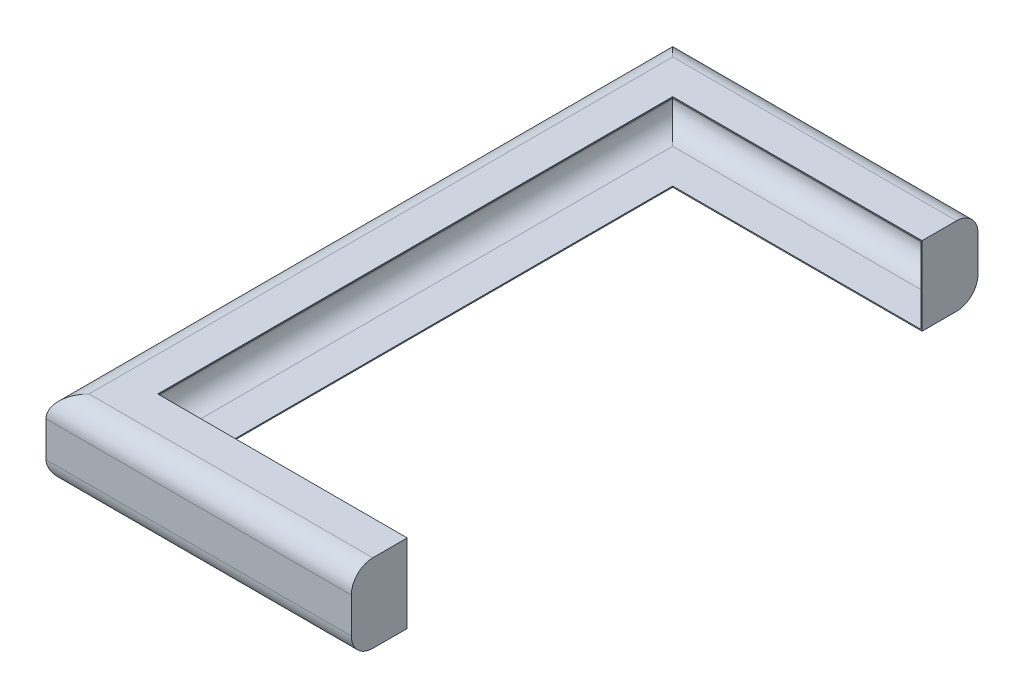
ISO-10303-21;
HEADER;
FILE_DESCRIPTION(('STEP AP214'),'2;1');
FILE_NAME('part.step','',(''),(''),'','','');
FILE_SCHEMA(('AUTOMOTIVE_DESIGN { 1 0 10303 214 1 1 1 1 }'));
ENDSEC;
DATA;
#1=APPLICATION_CONTEXT('core data for automotive mechanical design processes');
#2=APPLICATION_PROTOCOL_DEFINITION('international standard','automotive_design',2000,#1);
#3=PRODUCT_CONTEXT('',#1,'mechanical');
#4=PRODUCT('Part','Part','',(#3));
#5=PRODUCT_RELATED_PRODUCT_CATEGORY('part','',(#4));
#6=PRODUCT_DEFINITION_FORMATION('','',#4);
#7=PRODUCT_DEFINITION_CONTEXT('part definition',#1,'design');
#8=PRODUCT_DEFINITION('design','',#6,#7);
#9=PRODUCT_DEFINITION_SHAPE('','',#8);
#10=(LENGTH_UNIT() NAMED_UNIT(*) SI_UNIT(.MILLI.,.METRE.));
#11=(NAMED_UNIT(*) PLANE_ANGLE_UNIT() SI_UNIT($,.RADIAN.));
#12=(NAMED_UNIT(*) SI_UNIT($,.STERADIAN.) SOLID_ANGLE_UNIT());
#13=UNCERTAINTY_MEASURE_WITH_UNIT(LENGTH_MEASURE(1.E-05),#10,'distance_accuracy_value','');
#14=(GEOMETRIC_REPRESENTATION_CONTEXT(3) GLOBAL_UNCERTAINTY_ASSIGNED_CONTEXT((#13)) GLOBAL_UNIT_ASSIGNED_CONTEXT((#10,
#11,#12)) REPRESENTATION_CONTEXT('',''));
#15=CARTESIAN_POINT('',(0.,0.,0.));
#16=DIRECTION('',(0.,0.,1.));
#17=DIRECTION('',(1.,0.,0.));
#18=AXIS2_PLACEMENT_3D('',#15,#16,#17);
#19=CARTESIAN_POINT('',(1.5899202076085E-13,57.94375,380.2126));
#20=DIRECTION('',(0.,0.,1.));
#21=DIRECTION('',(1.,0.,0.));
#22=AXIS2_PLACEMENT_3D('',#19,#20,#21);
#23=PLANE('',#22);
#24=DIRECTION('',(-1.,0.,0.));
#25=VECTOR('',#24,1.);
#26=CARTESIAN_POINT('',(0.,-56.35625,380.2126));
#27=LINE('',#26,#25);
#28=CARTESIAN_POINT('',(366.7125,-56.35625,380.2126));
#29=VERTEX_POINT('',#28);
#30=CARTESIAN_POINT('',(1.5899202076085E-13,-56.35625,380.2126));
#31=VERTEX_POINT('',#30);
#32=EDGE_CURVE('E269',#29,#31,#27,.T.);
#33=ORIENTED_EDGE('',*,*,#32,.F.);
#34=DIRECTION('',(0.,-1.,0.));
#35=VECTOR('',#34,1.);
#36=CARTESIAN_POINT('',(366.7125,57.94375,380.2126));
#37=LINE('',#36,#35);
#38=CARTESIAN_POINT('',(366.7125,56.35625,380.2126));
#39=VERTEX_POINT('',#38);
#40=EDGE_CURVE('E263',#39,#29,#37,.T.);
#41=ORIENTED_EDGE('',*,*,#40,.F.);
#42=DIRECTION('',(-1.,0.,0.));
#43=VECTOR('',#42,1.);
#44=CARTESIAN_POINT('',(0.,56.35625,380.2126));
#45=LINE('',#44,#43);
#46=CARTESIAN_POINT('',(1.5899202076085E-13,56.35625,380.2126));
#47=VERTEX_POINT('',#46);
#48=EDGE_CURVE('E273',#39,#47,#45,.T.);
#49=ORIENTED_EDGE('',*,*,#48,.T.);
#50=DIRECTION('',(0.,-1.,0.));
#51=VECTOR('',#50,1.);
#52=CARTESIAN_POINT('',(1.5899202076085E-13,57.94375,380.2126));
#53=LINE('',#52,#51);
#54=CARTESIAN_POINT('',(1.5899202076085E-13,57.94375,380.2126));
#55=VERTEX_POINT('',#54);
#56=EDGE_CURVE('E346',#55,#47,#53,.T.);
#57=ORIENTED_EDGE('',*,*,#56,.F.);
#58=DIRECTION('',(-1.,0.,0.));
#59=VECTOR('',#58,1.);
#60=CARTESIAN_POINT('',(1.5899202076085E-13,57.94375,380.2126));
#61=LINE('',#60,#59);
#62=CARTESIAN_POINT('',(368.3,57.94375,380.2126));
#63=VERTEX_POINT('',#62);
#64=EDGE_CURVE('E319',#63,#55,#61,.T.);
#65=ORIENTED_EDGE('',*,*,#64,.F.);
#66=DIRECTION('',(0.,-1.,0.));
#67=VECTOR('',#66,1.);
#68=CARTESIAN_POINT('',(368.3,57.94375,380.2126));
#69=LINE('',#68,#67);
#70=CARTESIAN_POINT('',(368.3,-57.94375,380.2126));
#71=VERTEX_POINT('',#70);
#72=EDGE_CURVE('E349',#63,#71,#69,.T.);
#73=ORIENTED_EDGE('',*,*,#72,.T.);
#74=DIRECTION('',(-1.,0.,0.));
#75=VECTOR('',#74,1.);
#76=CARTESIAN_POINT('',(1.5899202076085E-13,-57.94375,380.2126));
#77=LINE('',#76,#75);
#78=CARTESIAN_POINT('',(1.5899202076085E-13,-57.94375,380.2126));
#79=VERTEX_POINT('',#78);
#80=EDGE_CURVE('E332',#71,#79,#77,.T.);
#81=ORIENTED_EDGE('',*,*,#80,.T.);
#82=EDGE_CURVE('E345',#31,#79,#53,.T.);
#83=ORIENTED_EDGE('',*,*,#82,.F.);
#84=EDGE_LOOP('',(#33,#41,#49,#57,#65,#73,#81,#83));
#85=FACE_BOUND('',#84,.T.);
#86=ADVANCED_FACE('F49',(#85),#23,.F.);
#87=CARTESIAN_POINT('',(1.5899202076085E-13,57.94375,-380.2126));
#88=DIRECTION('',(-1.,0.,0.));
#89=DIRECTION('',(0.,0.,1.));
#90=AXIS2_PLACEMENT_3D('',#87,#88,#89);
#91=PLANE('',#90);
#92=DIRECTION('',(0.,0.,-1.));
#93=VECTOR('',#92,1.);
#94=CARTESIAN_POINT('',(1.5899202076085E-13,-56.35625,0.));
#95=LINE('',#94,#93);
#96=CARTESIAN_POINT('',(1.5899202076085E-13,-56.35625,-380.2126));
#97=VERTEX_POINT('',#96);
#98=EDGE_CURVE('E309',#31,#97,#95,.T.);
#99=ORIENTED_EDGE('',*,*,#98,.F.);
#100=ORIENTED_EDGE('',*,*,#82,.T.);
#101=DIRECTION('',(0.,0.,-1.));
#102=VECTOR('',#101,1.);
#103=CARTESIAN_POINT('',(1.5899202076085E-13,-57.94375,-380.2126));
#104=LINE('',#103,#102);
#105=CARTESIAN_POINT('',(1.5899202076085E-13,-57.94375,-380.2126));
#106=VERTEX_POINT('',#105);
#107=EDGE_CURVE('E335',#79,#106,#104,.T.);
#108=ORIENTED_EDGE('',*,*,#107,.T.);
#109=DIRECTION('',(0.,-1.,0.));
#110=VECTOR('',#109,1.);
#111=CARTESIAN_POINT('',(1.5899202076085E-13,57.94375,-380.2126));
#112=LINE('',#111,#110);
#113=EDGE_CURVE('E341',#97,#106,#112,.T.);
#114=ORIENTED_EDGE('',*,*,#113,.F.);
#115=EDGE_LOOP('',(#99,#100,#108,#114));
#116=FACE_BOUND('',#115,.T.);
#117=ADVANCED_FACE('F467',(#116),#91,.F.);
#118=CARTESIAN_POINT('',(368.3,57.94375,-380.2126));
#119=DIRECTION('',(0.,0.,-1.));
#120=DIRECTION('',(-1.,0.,0.));
#121=AXIS2_PLACEMENT_3D('',#118,#119,#120);
#122=PLANE('',#121);
#123=DIRECTION('',(1.,0.,0.));
#124=VECTOR('',#123,1.);
#125=CARTESIAN_POINT('',(0.,-56.35625,-380.2126));
#126=LINE('',#125,#124);
#127=CARTESIAN_POINT('',(366.7125,-56.35625,-380.2126));
#128=VERTEX_POINT('',#127);
#129=EDGE_CURVE('E311',#97,#128,#126,.T.);
#130=ORIENTED_EDGE('',*,*,#129,.F.);
#131=ORIENTED_EDGE('',*,*,#113,.T.);
#132=DIRECTION('',(1.,0.,0.));
#133=VECTOR('',#132,1.);
#134=CARTESIAN_POINT('',(368.3,-57.94375,-380.2126));
#135=LINE('',#134,#133);
#136=CARTESIAN_POINT('',(368.3,-57.94375,-380.2126));
#137=VERTEX_POINT('',#136);
#138=EDGE_CURVE('E317',#106,#137,#135,.T.);
#139=ORIENTED_EDGE('',*,*,#138,.T.);
#140=DIRECTION('',(0.,-1.,0.));
#141=VECTOR('',#140,1.);
#142=CARTESIAN_POINT('',(368.3,57.94375,-380.2126));
#143=LINE('',#142,#141);
#144=CARTESIAN_POINT('',(368.3,57.94375,-380.2126));
#145=VERTEX_POINT('',#144);
#146=EDGE_CURVE('E325',#145,#137,#143,.T.);
#147=ORIENTED_EDGE('',*,*,#146,.F.);
#148=DIRECTION('',(1.,0.,0.));
#149=VECTOR('',#148,1.);
#150=CARTESIAN_POINT('',(368.3,57.94375,-380.2126));
#151=LINE('',#150,#149);
#152=CARTESIAN_POINT('',(1.5899202076085E-13,57.94375,-380.2126));
#153=VERTEX_POINT('',#152);
#154=EDGE_CURVE('E323',#153,#145,#151,.T.);
#155=ORIENTED_EDGE('',*,*,#154,.F.);
#156=CARTESIAN_POINT('',(1.5899202076085E-13,56.35625,-380.2126));
#157=VERTEX_POINT('',#156);
#158=EDGE_CURVE('E342',#153,#157,#112,.T.);
#159=ORIENTED_EDGE('',*,*,#158,.T.);
#160=DIRECTION('',(1.,0.,0.));
#161=VECTOR('',#160,1.);
#162=CARTESIAN_POINT('',(0.,56.35625,-380.2126));
#163=LINE('',#162,#161);
#164=CARTESIAN_POINT('',(366.7125,56.35625,-380.2126));
#165=VERTEX_POINT('',#164);
#166=EDGE_CURVE('E298',#157,#165,#163,.T.);
#167=ORIENTED_EDGE('',*,*,#166,.T.);
#168=DIRECTION('',(0.,-1.,0.));
#169=VECTOR('',#168,1.);
#170=CARTESIAN_POINT('',(366.7125,57.94375,-380.2126));
#171=LINE('',#170,#169);
#172=EDGE_CURVE('E295',#165,#128,#171,.T.);
#173=ORIENTED_EDGE('',*,*,#172,.T.);
#174=EDGE_LOOP('',(#130,#131,#139,#147,#155,#159,#167,#173));
#175=FACE_BOUND('',#174,.T.);
#176=ADVANCED_FACE('F428',(#175),#122,.F.);
#177=CARTESIAN_POINT('',(368.3,57.94375,-462.7626));
#178=DIRECTION('',(-1.,0.,0.));
#179=DIRECTION('',(0.,0.,1.));
#180=AXIS2_PLACEMENT_3D('',#177,#178,#179);
#181=PLANE('',#180);
#182=DIRECTION('',(0.,0.,-1.));
#183=VECTOR('',#182,1.);
#184=CARTESIAN_POINT('',(368.3,-57.94375,-462.7626));
#185=LINE('',#184,#183);
#186=CARTESIAN_POINT('',(368.3,-57.94375,-431.0126));
#187=VERTEX_POINT('',#186);
#188=EDGE_CURVE('E326',#137,#187,#185,.T.);
#189=ORIENTED_EDGE('',*,*,#188,.T.);
#190=CARTESIAN_POINT('',(368.3,-26.19375,-431.0126));
#191=DIRECTION('',(-1.,0.,0.));
#192=DIRECTION('',(0.,0.,1.));
#193=AXIS2_PLACEMENT_3D('',#190,#191,#192);
#194=CIRCLE('',#193,31.75);
#195=CARTESIAN_POINT('',(368.3,-26.19375,-462.7626));
#196=VERTEX_POINT('',#195);
#197=EDGE_CURVE('E389',#187,#196,#194,.F.);
#198=ORIENTED_EDGE('',*,*,#197,.T.);
#199=DIRECTION('',(0.,-1.,0.));
#200=VECTOR('',#199,1.);
#201=CARTESIAN_POINT('',(368.3,57.94375,-462.7626));
#202=LINE('',#201,#200);
#203=CARTESIAN_POINT('',(368.3,26.19375,-462.7626));
#204=VERTEX_POINT('',#203);
#205=EDGE_CURVE('E361',#204,#196,#202,.T.);
#206=ORIENTED_EDGE('',*,*,#205,.F.);
#207=CARTESIAN_POINT('',(368.3,26.19375,-431.0126));
#208=DIRECTION('',(-1.,0.,0.));
#209=DIRECTION('',(0.,0.,1.));
#210=AXIS2_PLACEMENT_3D('',#207,#208,#209);
#211=CIRCLE('',#210,31.75);
#212=CARTESIAN_POINT('',(368.3,57.94375,-431.0126));
#213=VERTEX_POINT('',#212);
#214=EDGE_CURVE('E387',#204,#213,#211,.F.);
#215=ORIENTED_EDGE('',*,*,#214,.T.);
#216=DIRECTION('',(0.,0.,-1.));
#217=VECTOR('',#216,1.);
#218=CARTESIAN_POINT('',(368.3,57.94375,-462.7626));
#219=LINE('',#218,#217);
#220=EDGE_CURVE('E313',#145,#213,#219,.T.);
#221=ORIENTED_EDGE('',*,*,#220,.F.);
#222=ORIENTED_EDGE('',*,*,#146,.T.);
#223=EDGE_LOOP('',(#189,#198,#206,#215,#221,#222));
#224=FACE_BOUND('',#223,.T.);
#225=ADVANCED_FACE('F433',(#224),#181,.F.);
#226=CARTESIAN_POINT('',(-82.5499999999998,57.94375,-462.7626));
#227=DIRECTION('',(0.,0.,1.));
#228=DIRECTION('',(1.,0.,0.));
#229=AXIS2_PLACEMENT_3D('',#226,#227,#228);
#230=PLANE('',#229);
#231=ORIENTED_EDGE('',*,*,#205,.T.);
#232=DIRECTION('',(-1.,0.,0.));
#233=VECTOR('',#232,1.);
#234=CARTESIAN_POINT('',(-82.5499999999998,-26.19375,-462.7626));
#235=LINE('',#234,#233);
#236=CARTESIAN_POINT('',(-82.5499999999998,-26.19375,-462.7626));
#237=VERTEX_POINT('',#236);
#238=EDGE_CURVE('E385',#196,#237,#235,.T.);
#239=ORIENTED_EDGE('',*,*,#238,.T.);
#240=DIRECTION('',(0.,-1.,0.));
#241=VECTOR('',#240,1.);
#242=CARTESIAN_POINT('',(-82.5499999999998,57.94375,-462.7626));
#243=LINE('',#242,#241);
#244=CARTESIAN_POINT('',(-82.5499999999998,26.19375,-462.7626));
#245=VERTEX_POINT('',#244);
#246=EDGE_CURVE('E358',#245,#237,#243,.T.);
#247=ORIENTED_EDGE('',*,*,#246,.F.);
#248=DIRECTION('',(-1.,0.,0.));
#249=VECTOR('',#248,1.);
#250=CARTESIAN_POINT('',(-82.5499999999998,26.19375,-462.7626));
#251=LINE('',#250,#249);
#252=EDGE_CURVE('E383',#245,#204,#251,.F.);
#253=ORIENTED_EDGE('',*,*,#252,.T.);
#254=EDGE_LOOP('',(#231,#239,#247,#253));
#255=FACE_BOUND('',#254,.T.);
#256=ADVANCED_FACE('F439',(#255),#230,.F.);
#257=CARTESIAN_POINT('',(-82.55,57.94375,462.7626));
#258=DIRECTION('',(1.,0.,0.));
#259=DIRECTION('',(0.,0.,-1.));
#260=AXIS2_PLACEMENT_3D('',#257,#258,#259);
#261=PLANE('',#260);
#262=ORIENTED_EDGE('',*,*,#246,.T.);
#263=DIRECTION('',(0.,0.,1.));
#264=VECTOR('',#263,1.);
#265=CARTESIAN_POINT('',(-82.55,-26.19375,462.7626));
#266=LINE('',#265,#264);
#267=CARTESIAN_POINT('',(-82.55,-26.19375,462.7626));
#268=VERTEX_POINT('',#267);
#269=EDGE_CURVE('E381',#237,#268,#266,.T.);
#270=ORIENTED_EDGE('',*,*,#269,.T.);
#271=DIRECTION('',(0.,-1.,0.));
#272=VECTOR('',#271,1.);
#273=CARTESIAN_POINT('',(-82.55,57.94375,462.7626));
#274=LINE('',#273,#272);
#275=CARTESIAN_POINT('',(-82.55,26.19375,462.7626));
#276=VERTEX_POINT('',#275);
#277=EDGE_CURVE('E355',#276,#268,#274,.T.);
#278=ORIENTED_EDGE('',*,*,#277,.F.);
#279=DIRECTION('',(0.,0.,1.));
#280=VECTOR('',#279,1.);
#281=CARTESIAN_POINT('',(-82.55,26.19375,462.7626));
#282=LINE('',#281,#280);
#283=EDGE_CURVE('E379',#276,#245,#282,.F.);
#284=ORIENTED_EDGE('',*,*,#283,.T.);
#285=EDGE_LOOP('',(#262,#270,#278,#284));
#286=FACE_BOUND('',#285,.T.);
#287=ADVANCED_FACE('F448',(#286),#261,.F.);
#288=CARTESIAN_POINT('',(368.3,57.94375,462.7626));
#289=DIRECTION('',(0.,0.,-1.));
#290=DIRECTION('',(-1.,0.,0.));
#291=AXIS2_PLACEMENT_3D('',#288,#289,#290);
#292=PLANE('',#291);
#293=ORIENTED_EDGE('',*,*,#277,.T.);
#294=DIRECTION('',(1.,0.,0.));
#295=VECTOR('',#294,1.);
#296=CARTESIAN_POINT('',(368.3,-26.19375,462.7626));
#297=LINE('',#296,#295);
#298=CARTESIAN_POINT('',(368.3,-26.19375,462.7626));
#299=VERTEX_POINT('',#298);
#300=EDGE_CURVE('E366',#268,#299,#297,.T.);
#301=ORIENTED_EDGE('',*,*,#300,.T.);
#302=DIRECTION('',(0.,-1.,0.));
#303=VECTOR('',#302,1.);
#304=CARTESIAN_POINT('',(368.3,57.94375,462.7626));
#305=LINE('',#304,#303);
#306=CARTESIAN_POINT('',(368.3,26.19375,462.7626));
#307=VERTEX_POINT('',#306);
#308=EDGE_CURVE('E352',#307,#299,#305,.T.);
#309=ORIENTED_EDGE('',*,*,#308,.F.);
#310=DIRECTION('',(1.,0.,0.));
#311=VECTOR('',#310,1.);
#312=CARTESIAN_POINT('',(368.3,26.19375,462.7626));
#313=LINE('',#312,#311);
#314=EDGE_CURVE('E364',#307,#276,#313,.F.);
#315=ORIENTED_EDGE('',*,*,#314,.T.);
#316=EDGE_LOOP('',(#293,#301,#309,#315));
#317=FACE_BOUND('',#316,.T.);
#318=ADVANCED_FACE('F452',(#317),#292,.F.);
#319=CARTESIAN_POINT('',(368.3,57.94375,380.2126));
#320=DIRECTION('',(-1.,0.,0.));
#321=DIRECTION('',(0.,0.,1.));
#322=AXIS2_PLACEMENT_3D('',#319,#320,#321);
#323=PLANE('',#322);
#324=ORIENTED_EDGE('',*,*,#308,.T.);
#325=CARTESIAN_POINT('',(368.3,-26.19375,431.0126));
#326=DIRECTION('',(-1.,0.,0.));
#327=DIRECTION('',(0.,0.,1.));
#328=AXIS2_PLACEMENT_3D('',#325,#326,#327);
#329=CIRCLE('',#328,31.75);
#330=CARTESIAN_POINT('',(368.3,-57.94375,431.0126));
#331=VERTEX_POINT('',#330);
#332=EDGE_CURVE('E371',#299,#331,#329,.F.);
#333=ORIENTED_EDGE('',*,*,#332,.T.);
#334=DIRECTION('',(0.,0.,-1.));
#335=VECTOR('',#334,1.);
#336=CARTESIAN_POINT('',(368.3,-57.94375,380.2126));
#337=LINE('',#336,#335);
#338=EDGE_CURVE('E329',#331,#71,#337,.T.);
#339=ORIENTED_EDGE('',*,*,#338,.T.);
#340=ORIENTED_EDGE('',*,*,#72,.F.);
#341=DIRECTION('',(0.,0.,-1.));
#342=VECTOR('',#341,1.);
#343=CARTESIAN_POINT('',(368.3,57.94375,380.2126));
#344=LINE('',#343,#342);
#345=CARTESIAN_POINT('',(368.3,57.94375,431.0126));
#346=VERTEX_POINT('',#345);
#347=EDGE_CURVE('E316',#346,#63,#344,.T.);
#348=ORIENTED_EDGE('',*,*,#347,.F.);
#349=CARTESIAN_POINT('',(368.3,26.19375,431.0126));
#350=DIRECTION('',(-1.,0.,0.));
#351=DIRECTION('',(0.,0.,1.));
#352=AXIS2_PLACEMENT_3D('',#349,#350,#351);
#353=CIRCLE('',#352,31.75);
#354=EDGE_CURVE('E369',#346,#307,#353,.F.);
#355=ORIENTED_EDGE('',*,*,#354,.T.);
#356=EDGE_LOOP('',(#324,#333,#339,#340,#348,#355));
#357=FACE_BOUND('',#356,.T.);
#358=ADVANCED_FACE('F412',(#357),#323,.F.);
#359=ORIENTED_EDGE('',*,*,#56,.T.);
#360=DIRECTION('',(0.,0.,-1.));
#361=VECTOR('',#360,1.);
#362=CARTESIAN_POINT('',(1.5899202076085E-13,56.35625,0.));
#363=LINE('',#362,#361);
#364=EDGE_CURVE('E301',#47,#157,#363,.T.);
#365=ORIENTED_EDGE('',*,*,#364,.T.);
#366=ORIENTED_EDGE('',*,*,#158,.F.);
#367=DIRECTION('',(0.,0.,-1.));
#368=VECTOR('',#367,1.);
#369=CARTESIAN_POINT('',(1.5899202076085E-13,57.94375,-380.2126));
#370=LINE('',#369,#368);
#371=EDGE_CURVE('E321',#55,#153,#370,.T.);
#372=ORIENTED_EDGE('',*,*,#371,.F.);
#373=EDGE_LOOP('',(#359,#365,#366,#372));
#374=FACE_BOUND('',#373,.T.);
#375=ADVANCED_FACE('F425',(#374),#91,.F.);
#376=CARTESIAN_POINT('',(0.,57.94375,0.));
#377=DIRECTION('',(0.,-1.,0.));
#378=DIRECTION('',(0.,0.,-1.));
#379=AXIS2_PLACEMENT_3D('',#376,#377,#378);
#380=PLANE('',#379);
#381=ORIENTED_EDGE('',*,*,#220,.T.);
#382=DIRECTION('',(-1.,0.,0.));
#383=VECTOR('',#382,1.);
#384=CARTESIAN_POINT('',(0.,57.94375,-431.0126));
#385=LINE('',#384,#383);
#386=CARTESIAN_POINT('',(-50.7999999999999,57.94375,-431.0126));
#387=VERTEX_POINT('',#386);
#388=EDGE_CURVE('E11',#213,#387,#385,.T.);
#389=ORIENTED_EDGE('',*,*,#388,.T.);
#390=DIRECTION('',(0.,0.,1.));
#391=VECTOR('',#390,1.);
#392=CARTESIAN_POINT('',(-50.7999999999999,57.94375,0.));
#393=LINE('',#392,#391);
#394=CARTESIAN_POINT('',(-50.7999999999999,57.94375,431.0126));
#395=VERTEX_POINT('',#394);
#396=EDGE_CURVE('E58',#387,#395,#393,.T.);
#397=ORIENTED_EDGE('',*,*,#396,.T.);
#398=DIRECTION('',(1.,0.,0.));
#399=VECTOR('',#398,1.);
#400=CARTESIAN_POINT('',(0.,57.94375,431.0126));
#401=LINE('',#400,#399);
#402=EDGE_CURVE('E391',#395,#346,#401,.T.);
#403=ORIENTED_EDGE('',*,*,#402,.T.);
#404=ORIENTED_EDGE('',*,*,#347,.T.);
#405=ORIENTED_EDGE('',*,*,#64,.T.);
#406=ORIENTED_EDGE('',*,*,#371,.T.);
#407=ORIENTED_EDGE('',*,*,#154,.T.);
#408=EDGE_LOOP('',(#381,#389,#397,#403,#404,#405,#406,#407));
#409=FACE_BOUND('',#408,.T.);
#410=ADVANCED_FACE('F409',(#409),#380,.F.);
#411=CARTESIAN_POINT('',(0.,-57.94375,0.));
#412=DIRECTION('',(0.,-1.,0.));
#413=DIRECTION('',(0.,0.,-1.));
#414=AXIS2_PLACEMENT_3D('',#411,#412,#413);
#415=PLANE('',#414);
#416=ORIENTED_EDGE('',*,*,#338,.F.);
#417=DIRECTION('',(1.,0.,0.));
#418=VECTOR('',#417,1.);
#419=CARTESIAN_POINT('',(-82.55,-57.94375,431.0126));
#420=LINE('',#419,#418);
#421=CARTESIAN_POINT('',(-50.7999999999999,-57.94375,431.0126));
#422=VERTEX_POINT('',#421);
#423=EDGE_CURVE('E377',#331,#422,#420,.F.);
#424=ORIENTED_EDGE('',*,*,#423,.T.);
#425=DIRECTION('',(0.,0.,1.));
#426=VECTOR('',#425,1.);
#427=CARTESIAN_POINT('',(-50.7999999999998,-57.94375,-462.7626));
#428=LINE('',#427,#426);
#429=CARTESIAN_POINT('',(-50.7999999999999,-57.94375,-431.0126));
#430=VERTEX_POINT('',#429);
#431=EDGE_CURVE('E375',#422,#430,#428,.F.);
#432=ORIENTED_EDGE('',*,*,#431,.T.);
#433=DIRECTION('',(-1.,0.,0.));
#434=VECTOR('',#433,1.);
#435=CARTESIAN_POINT('',(368.3,-57.94375,-431.0126));
#436=LINE('',#435,#434);
#437=EDGE_CURVE('E373',#430,#187,#436,.F.);
#438=ORIENTED_EDGE('',*,*,#437,.T.);
#439=ORIENTED_EDGE('',*,*,#188,.F.);
#440=ORIENTED_EDGE('',*,*,#138,.F.);
#441=ORIENTED_EDGE('',*,*,#107,.F.);
#442=ORIENTED_EDGE('',*,*,#80,.F.);
#443=EDGE_LOOP('',(#416,#424,#432,#438,#439,#440,#441,#442));
#444=FACE_BOUND('',#443,.T.);
#445=ADVANCED_FACE('F461',(#444),#415,.T.);
#446=CARTESIAN_POINT('',(-82.5499999999998,-26.19375,-431.0126));
#447=DIRECTION('',(1.,0.,0.));
#448=DIRECTION('',(0.,0.,-1.));
#449=AXIS2_PLACEMENT_3D('',#446,#447,#448);
#450=CYLINDRICAL_SURFACE('',#449,31.75);
#451=ORIENTED_EDGE('',*,*,#197,.F.);
#452=ORIENTED_EDGE('',*,*,#437,.F.);
#453=CARTESIAN_POINT('',(-50.7999999999999,-26.19375,-431.0126));
#454=DIRECTION('',(0.707106781186547,0.,-0.707106781186547));
#455=DIRECTION('',(0.707106781186547,0.,0.707106781186547));
#456=AXIS2_PLACEMENT_3D('',#453,#454,#455);
#457=ELLIPSE('',#456,44.9012806053458,31.75);
#458=EDGE_CURVE('E330',#237,#430,#457,.F.);
#459=ORIENTED_EDGE('',*,*,#458,.F.);
#460=ORIENTED_EDGE('',*,*,#238,.F.);
#461=EDGE_LOOP('',(#451,#452,#459,#460));
#462=FACE_BOUND('',#461,.T.);
#463=ADVANCED_FACE('F444',(#462),#450,.T.);
#464=CARTESIAN_POINT('',(-50.8,-26.19375,462.7626));
#465=DIRECTION('',(0.,0.,-1.));
#466=DIRECTION('',(-1.,0.,0.));
#467=AXIS2_PLACEMENT_3D('',#464,#465,#466);
#468=CYLINDRICAL_SURFACE('',#467,31.75);
#469=ORIENTED_EDGE('',*,*,#458,.T.);
#470=ORIENTED_EDGE('',*,*,#431,.F.);
#471=CARTESIAN_POINT('',(-50.8,-26.19375,431.0126));
#472=DIRECTION('',(-0.707106781186547,0.,-0.707106781186548));
#473=DIRECTION('',(0.707106781186548,0.,-0.707106781186547));
#474=AXIS2_PLACEMENT_3D('',#471,#472,#473);
#475=ELLIPSE('',#474,44.9012806053458,31.75);
#476=EDGE_CURVE('E394',#268,#422,#475,.F.);
#477=ORIENTED_EDGE('',*,*,#476,.F.);
#478=ORIENTED_EDGE('',*,*,#269,.F.);
#479=EDGE_LOOP('',(#469,#470,#477,#478));
#480=FACE_BOUND('',#479,.T.);
#481=ADVANCED_FACE('F456',(#480),#468,.T.);
#482=CARTESIAN_POINT('',(368.3,-26.19375,431.0126));
#483=DIRECTION('',(-1.,0.,0.));
#484=DIRECTION('',(0.,0.,1.));
#485=AXIS2_PLACEMENT_3D('',#482,#483,#484);
#486=CYLINDRICAL_SURFACE('',#485,31.75);
#487=ORIENTED_EDGE('',*,*,#476,.T.);
#488=ORIENTED_EDGE('',*,*,#423,.F.);
#489=ORIENTED_EDGE('',*,*,#332,.F.);
#490=ORIENTED_EDGE('',*,*,#300,.F.);
#491=EDGE_LOOP('',(#487,#488,#489,#490));
#492=FACE_BOUND('',#491,.T.);
#493=ADVANCED_FACE('F459',(#492),#486,.T.);
#494=CARTESIAN_POINT('',(0.,26.19375,431.0126));
#495=DIRECTION('',(1.,0.,0.));
#496=DIRECTION('',(0.,0.,-1.));
#497=AXIS2_PLACEMENT_3D('',#494,#495,#496);
#498=CYLINDRICAL_SURFACE('',#497,31.75);
#499=ORIENTED_EDGE('',*,*,#354,.F.);
#500=ORIENTED_EDGE('',*,*,#402,.F.);
#501=CARTESIAN_POINT('',(-50.7999999999999,26.19375,431.0126));
#502=DIRECTION('',(0.707106781186547,0.,0.707106781186548));
#503=DIRECTION('',(0.707106781186548,0.,-0.707106781186547));
#504=AXIS2_PLACEMENT_3D('',#501,#502,#503);
#505=ELLIPSE('',#504,44.9012806053458,31.75);
#506=EDGE_CURVE('E53',#276,#395,#505,.F.);
#507=ORIENTED_EDGE('',*,*,#506,.F.);
#508=ORIENTED_EDGE('',*,*,#314,.F.);
#509=EDGE_LOOP('',(#499,#500,#507,#508));
#510=FACE_BOUND('',#509,.T.);
#511=ADVANCED_FACE('F51',(#510),#498,.T.);
#512=CARTESIAN_POINT('',(-50.7999999999999,26.19375,0.));
#513=DIRECTION('',(0.,0.,1.));
#514=DIRECTION('',(1.,0.,0.));
#515=AXIS2_PLACEMENT_3D('',#512,#513,#514);
#516=CYLINDRICAL_SURFACE('',#515,31.75);
#517=ORIENTED_EDGE('',*,*,#506,.T.);
#518=ORIENTED_EDGE('',*,*,#396,.F.);
#519=CARTESIAN_POINT('',(-50.7999999999999,26.19375,-431.0126));
#520=DIRECTION('',(-0.707106781186547,0.,0.707106781186547));
#521=DIRECTION('',(0.707106781186547,0.,0.707106781186547));
#522=AXIS2_PLACEMENT_3D('',#519,#520,#521);
#523=ELLIPSE('',#522,44.9012806053458,31.75);
#524=EDGE_CURVE('E74',#245,#387,#523,.F.);
#525=ORIENTED_EDGE('',*,*,#524,.F.);
#526=ORIENTED_EDGE('',*,*,#283,.F.);
#527=EDGE_LOOP('',(#517,#518,#525,#526));
#528=FACE_BOUND('',#527,.T.);
#529=ADVANCED_FACE('F402',(#528),#516,.T.);
#530=CARTESIAN_POINT('',(0.,26.19375,-431.0126));
#531=DIRECTION('',(-1.,0.,0.));
#532=DIRECTION('',(0.,0.,1.));
#533=AXIS2_PLACEMENT_3D('',#530,#531,#532);
#534=CYLINDRICAL_SURFACE('',#533,31.75);
#535=ORIENTED_EDGE('',*,*,#214,.F.);
#536=ORIENTED_EDGE('',*,*,#252,.F.);
#537=ORIENTED_EDGE('',*,*,#524,.T.);
#538=ORIENTED_EDGE('',*,*,#388,.F.);
#539=EDGE_LOOP('',(#535,#536,#537,#538));
#540=FACE_BOUND('',#539,.T.);
#541=ADVANCED_FACE('F436',(#540),#534,.T.);
#542=CARTESIAN_POINT('',(366.7125,57.94375,-462.7626));
#543=DIRECTION('',(-1.,0.,0.));
#544=DIRECTION('',(0.,0.,1.));
#545=AXIS2_PLACEMENT_3D('',#542,#543,#544);
#546=PLANE('',#545);
#547=DIRECTION('',(0.,0.,-1.));
#548=VECTOR('',#547,1.);
#549=CARTESIAN_POINT('',(366.7125,-56.35625,2.46597614123472E-13));
#550=LINE('',#549,#548);
#551=CARTESIAN_POINT('',(366.7125,-56.35625,-431.0126));
#552=VERTEX_POINT('',#551);
#553=EDGE_CURVE('E270',#128,#552,#550,.T.);
#554=ORIENTED_EDGE('',*,*,#553,.F.);
#555=ORIENTED_EDGE('',*,*,#172,.F.);
#556=DIRECTION('',(0.,0.,-1.));
#557=VECTOR('',#556,1.);
#558=CARTESIAN_POINT('',(366.7125,56.35625,2.46597614123472E-13));
#559=LINE('',#558,#557);
#560=CARTESIAN_POINT('',(366.7125,56.35625,-431.0126));
#561=VERTEX_POINT('',#560);
#562=EDGE_CURVE('E66',#165,#561,#559,.T.);
#563=ORIENTED_EDGE('',*,*,#562,.T.);
#564=CARTESIAN_POINT('',(366.7125,26.19375,-431.0126));
#565=DIRECTION('',(-1.,0.,0.));
#566=DIRECTION('',(0.,0.,1.));
#567=AXIS2_PLACEMENT_3D('',#564,#565,#566);
#568=CIRCLE('',#567,30.1625);
#569=CARTESIAN_POINT('',(366.7125,26.19375,-461.1751));
#570=VERTEX_POINT('',#569);
#571=EDGE_CURVE('E227',#570,#561,#568,.F.);
#572=ORIENTED_EDGE('',*,*,#571,.F.);
#573=DIRECTION('',(0.,-1.,0.));
#574=VECTOR('',#573,1.);
#575=CARTESIAN_POINT('',(366.7125,57.94375,-461.1751));
#576=LINE('',#575,#574);
#577=CARTESIAN_POINT('',(366.7125,-26.19375,-461.1751));
#578=VERTEX_POINT('',#577);
#579=EDGE_CURVE('E231',#570,#578,#576,.T.);
#580=ORIENTED_EDGE('',*,*,#579,.T.);
#581=CARTESIAN_POINT('',(366.7125,-26.19375,-431.0126));
#582=DIRECTION('',(-1.,0.,0.));
#583=DIRECTION('',(0.,0.,1.));
#584=AXIS2_PLACEMENT_3D('',#581,#582,#583);
#585=CIRCLE('',#584,30.1625);
#586=EDGE_CURVE('E214',#552,#578,#585,.F.);
#587=ORIENTED_EDGE('',*,*,#586,.F.);
#588=EDGE_LOOP('',(#554,#555,#563,#572,#580,#587));
#589=FACE_BOUND('',#588,.T.);
#590=ADVANCED_FACE('F232',(#589),#546,.T.);
#591=CARTESIAN_POINT('',(-82.5499999999998,57.94375,-461.1751));
#592=DIRECTION('',(0.,0.,1.));
#593=DIRECTION('',(1.,0.,0.));
#594=AXIS2_PLACEMENT_3D('',#591,#592,#593);
#595=PLANE('',#594);
#596=ORIENTED_EDGE('',*,*,#579,.F.);
#597=DIRECTION('',(1.,0.,0.));
#598=VECTOR('',#597,1.);
#599=CARTESIAN_POINT('',(-82.5499999999998,26.19375,-461.1751));
#600=LINE('',#599,#598);
#601=CARTESIAN_POINT('',(-80.9624999999998,26.19375,-461.1751));
#602=VERTEX_POINT('',#601);
#603=EDGE_CURVE('E241',#602,#570,#600,.T.);
#604=ORIENTED_EDGE('',*,*,#603,.F.);
#605=DIRECTION('',(0.,-1.,0.));
#606=VECTOR('',#605,1.);
#607=CARTESIAN_POINT('',(-80.9624999999998,57.94375,-461.1751));
#608=LINE('',#607,#606);
#609=CARTESIAN_POINT('',(-80.9624999999998,-26.19375,-461.1751));
#610=VERTEX_POINT('',#609);
#611=EDGE_CURVE('E236',#602,#610,#608,.T.);
#612=ORIENTED_EDGE('',*,*,#611,.T.);
#613=DIRECTION('',(1.,0.,0.));
#614=VECTOR('',#613,1.);
#615=CARTESIAN_POINT('',(-82.5499999999998,-26.19375,-461.1751));
#616=LINE('',#615,#614);
#617=EDGE_CURVE('E219',#578,#610,#616,.F.);
#618=ORIENTED_EDGE('',*,*,#617,.F.);
#619=EDGE_LOOP('',(#596,#604,#612,#618));
#620=FACE_BOUND('',#619,.T.);
#621=ADVANCED_FACE('F238',(#620),#595,.T.);
#622=CARTESIAN_POINT('',(-80.9624999999999,57.94375,462.7626));
#623=DIRECTION('',(1.,0.,0.));
#624=DIRECTION('',(0.,0.,-1.));
#625=AXIS2_PLACEMENT_3D('',#622,#623,#624);
#626=PLANE('',#625);
#627=ORIENTED_EDGE('',*,*,#611,.F.);
#628=DIRECTION('',(0.,0.,-1.));
#629=VECTOR('',#628,1.);
#630=CARTESIAN_POINT('',(-80.9624999999999,26.19375,462.7626));
#631=LINE('',#630,#629);
#632=CARTESIAN_POINT('',(-80.9624999999999,26.19375,461.1751));
#633=VERTEX_POINT('',#632);
#634=EDGE_CURVE('E251',#633,#602,#631,.T.);
#635=ORIENTED_EDGE('',*,*,#634,.F.);
#636=DIRECTION('',(0.,-1.,0.));
#637=VECTOR('',#636,1.);
#638=CARTESIAN_POINT('',(-80.9624999999999,57.94375,461.1751));
#639=LINE('',#638,#637);
#640=CARTESIAN_POINT('',(-80.9624999999999,-26.19375,461.1751));
#641=VERTEX_POINT('',#640);
#642=EDGE_CURVE('E248',#633,#641,#639,.T.);
#643=ORIENTED_EDGE('',*,*,#642,.T.);
#644=DIRECTION('',(0.,0.,-1.));
#645=VECTOR('',#644,1.);
#646=CARTESIAN_POINT('',(-80.9624999999999,-26.19375,462.7626));
#647=LINE('',#646,#645);
#648=EDGE_CURVE('E244',#610,#641,#647,.F.);
#649=ORIENTED_EDGE('',*,*,#648,.F.);
#650=EDGE_LOOP('',(#627,#635,#643,#649));
#651=FACE_BOUND('',#650,.T.);
#652=ADVANCED_FACE('F478',(#651),#626,.T.);
#653=CARTESIAN_POINT('',(368.3,57.94375,461.1751));
#654=DIRECTION('',(0.,0.,-1.));
#655=DIRECTION('',(-1.,0.,0.));
#656=AXIS2_PLACEMENT_3D('',#653,#654,#655);
#657=PLANE('',#656);
#658=ORIENTED_EDGE('',*,*,#642,.F.);
#659=DIRECTION('',(-1.,0.,0.));
#660=VECTOR('',#659,1.);
#661=CARTESIAN_POINT('',(368.3,26.19375,461.1751));
#662=LINE('',#661,#660);
#663=CARTESIAN_POINT('',(366.7125,26.19375,461.1751));
#664=VERTEX_POINT('',#663);
#665=EDGE_CURVE('E235',#664,#633,#662,.T.);
#666=ORIENTED_EDGE('',*,*,#665,.F.);
#667=DIRECTION('',(0.,-1.,0.));
#668=VECTOR('',#667,1.);
#669=CARTESIAN_POINT('',(366.7125,57.94375,461.1751));
#670=LINE('',#669,#668);
#671=CARTESIAN_POINT('',(366.7125,-26.19375,461.1751));
#672=VERTEX_POINT('',#671);
#673=EDGE_CURVE('E254',#664,#672,#670,.T.);
#674=ORIENTED_EDGE('',*,*,#673,.T.);
#675=DIRECTION('',(-1.,0.,0.));
#676=VECTOR('',#675,1.);
#677=CARTESIAN_POINT('',(368.3,-26.19375,461.1751));
#678=LINE('',#677,#676);
#679=EDGE_CURVE('E257',#641,#672,#678,.F.);
#680=ORIENTED_EDGE('',*,*,#679,.F.);
#681=EDGE_LOOP('',(#658,#666,#674,#680));
#682=FACE_BOUND('',#681,.T.);
#683=ADVANCED_FACE('F488',(#682),#657,.T.);
#684=CARTESIAN_POINT('',(366.7125,57.94375,380.2126));
#685=DIRECTION('',(-1.,0.,0.));
#686=DIRECTION('',(0.,0.,1.));
#687=AXIS2_PLACEMENT_3D('',#684,#685,#686);
#688=PLANE('',#687);
#689=ORIENTED_EDGE('',*,*,#673,.F.);
#690=CARTESIAN_POINT('',(366.7125,26.19375,431.0126));
#691=DIRECTION('',(-1.,0.,0.));
#692=DIRECTION('',(0.,0.,1.));
#693=AXIS2_PLACEMENT_3D('',#690,#691,#692);
#694=CIRCLE('',#693,30.1625);
#695=CARTESIAN_POINT('',(366.7125,56.35625,431.0126));
#696=VERTEX_POINT('',#695);
#697=EDGE_CURVE('E260',#696,#664,#694,.F.);
#698=ORIENTED_EDGE('',*,*,#697,.F.);
#699=DIRECTION('',(0.,0.,-1.));
#700=VECTOR('',#699,1.);
#701=CARTESIAN_POINT('',(366.7125,56.35625,2.46597614123472E-13));
#702=LINE('',#701,#700);
#703=EDGE_CURVE('E271',#696,#39,#702,.T.);
#704=ORIENTED_EDGE('',*,*,#703,.T.);
#705=ORIENTED_EDGE('',*,*,#40,.T.);
#706=DIRECTION('',(0.,0.,-1.));
#707=VECTOR('',#706,1.);
#708=CARTESIAN_POINT('',(366.7125,-56.35625,2.46597614123472E-13));
#709=LINE('',#708,#707);
#710=CARTESIAN_POINT('',(366.7125,-56.35625,431.0126));
#711=VERTEX_POINT('',#710);
#712=EDGE_CURVE('E267',#711,#29,#709,.T.);
#713=ORIENTED_EDGE('',*,*,#712,.F.);
#714=CARTESIAN_POINT('',(366.7125,-26.19375,431.0126));
#715=DIRECTION('',(-1.,0.,0.));
#716=DIRECTION('',(0.,0.,1.));
#717=AXIS2_PLACEMENT_3D('',#714,#715,#716);
#718=CIRCLE('',#717,30.1625);
#719=EDGE_CURVE('E265',#672,#711,#718,.F.);
#720=ORIENTED_EDGE('',*,*,#719,.F.);
#721=EDGE_LOOP('',(#689,#698,#704,#705,#713,#720));
#722=FACE_BOUND('',#721,.T.);
#723=ADVANCED_FACE('F492',(#722),#688,.T.);
#724=CARTESIAN_POINT('',(0.,56.35625,0.));
#725=DIRECTION('',(0.,-1.,0.));
#726=DIRECTION('',(0.,0.,-1.));
#727=AXIS2_PLACEMENT_3D('',#724,#725,#726);
#728=PLANE('',#727);
#729=ORIENTED_EDGE('',*,*,#562,.F.);
#730=ORIENTED_EDGE('',*,*,#166,.F.);
#731=ORIENTED_EDGE('',*,*,#364,.F.);
#732=ORIENTED_EDGE('',*,*,#48,.F.);
#733=ORIENTED_EDGE('',*,*,#703,.F.);
#734=DIRECTION('',(1.,0.,0.));
#735=VECTOR('',#734,1.);
#736=CARTESIAN_POINT('',(0.,56.35625,431.0126));
#737=LINE('',#736,#735);
#738=CARTESIAN_POINT('',(-50.7999999999999,56.35625,431.0126));
#739=VERTEX_POINT('',#738);
#740=EDGE_CURVE('E226',#739,#696,#737,.T.);
#741=ORIENTED_EDGE('',*,*,#740,.F.);
#742=DIRECTION('',(0.,0.,-1.));
#743=VECTOR('',#742,1.);
#744=CARTESIAN_POINT('',(-50.7999999999999,56.35625,0.));
#745=LINE('',#744,#743);
#746=CARTESIAN_POINT('',(-50.7999999999999,56.35625,-431.0126));
#747=VERTEX_POINT('',#746);
#748=EDGE_CURVE('E278',#747,#739,#745,.F.);
#749=ORIENTED_EDGE('',*,*,#748,.F.);
#750=DIRECTION('',(1.,0.,0.));
#751=VECTOR('',#750,1.);
#752=CARTESIAN_POINT('',(0.,56.35625,-431.0126));
#753=LINE('',#752,#751);
#754=EDGE_CURVE('E275',#561,#747,#753,.F.);
#755=ORIENTED_EDGE('',*,*,#754,.F.);
#756=EDGE_LOOP('',(#729,#730,#731,#732,#733,#741,#749,#755));
#757=FACE_BOUND('',#756,.T.);
#758=ADVANCED_FACE('F496',(#757),#728,.T.);
#759=CARTESIAN_POINT('',(0.,-56.35625,0.));
#760=DIRECTION('',(0.,-1.,0.));
#761=DIRECTION('',(0.,0.,-1.));
#762=AXIS2_PLACEMENT_3D('',#759,#760,#761);
#763=PLANE('',#762);
#764=ORIENTED_EDGE('',*,*,#712,.T.);
#765=ORIENTED_EDGE('',*,*,#32,.T.);
#766=ORIENTED_EDGE('',*,*,#98,.T.);
#767=ORIENTED_EDGE('',*,*,#129,.T.);
#768=ORIENTED_EDGE('',*,*,#553,.T.);
#769=DIRECTION('',(1.,0.,0.));
#770=VECTOR('',#769,1.);
#771=CARTESIAN_POINT('',(0.,-56.35625,-431.0126));
#772=LINE('',#771,#770);
#773=CARTESIAN_POINT('',(-50.7999999999999,-56.35625,-431.0126));
#774=VERTEX_POINT('',#773);
#775=EDGE_CURVE('E222',#774,#552,#772,.T.);
#776=ORIENTED_EDGE('',*,*,#775,.F.);
#777=DIRECTION('',(0.,0.,-1.));
#778=VECTOR('',#777,1.);
#779=CARTESIAN_POINT('',(-50.7999999999999,-56.35625,0.));
#780=LINE('',#779,#778);
#781=CARTESIAN_POINT('',(-50.7999999999999,-56.35625,431.0126));
#782=VERTEX_POINT('',#781);
#783=EDGE_CURVE('E288',#782,#774,#780,.T.);
#784=ORIENTED_EDGE('',*,*,#783,.F.);
#785=DIRECTION('',(1.,0.,0.));
#786=VECTOR('',#785,1.);
#787=CARTESIAN_POINT('',(0.,-56.35625,431.0126));
#788=LINE('',#787,#786);
#789=EDGE_CURVE('E256',#711,#782,#788,.F.);
#790=ORIENTED_EDGE('',*,*,#789,.F.);
#791=EDGE_LOOP('',(#764,#765,#766,#767,#768,#776,#784,#790));
#792=FACE_BOUND('',#791,.T.);
#793=ADVANCED_FACE('F470',(#792),#763,.F.);
#794=CARTESIAN_POINT('',(-82.5499999999998,-26.19375,-431.0126));
#795=DIRECTION('',(1.,0.,0.));
#796=DIRECTION('',(0.,0.,-1.));
#797=AXIS2_PLACEMENT_3D('',#794,#795,#796);
#798=CYLINDRICAL_SURFACE('',#797,30.1625);
#799=ORIENTED_EDGE('',*,*,#586,.T.);
#800=ORIENTED_EDGE('',*,*,#617,.T.);
#801=CARTESIAN_POINT('',(-50.7999999999999,-26.19375,-431.0126));
#802=DIRECTION('',(0.707106781186547,0.,-0.707106781186547));
#803=DIRECTION('',(-0.707106781186547,0.,-0.707106781186547));
#804=AXIS2_PLACEMENT_3D('',#801,#802,#803);
#805=ELLIPSE('',#804,42.6562165750785,30.1625);
#806=EDGE_CURVE('E291',#610,#774,#805,.F.);
#807=ORIENTED_EDGE('',*,*,#806,.T.);
#808=ORIENTED_EDGE('',*,*,#775,.T.);
#809=EDGE_LOOP('',(#799,#800,#807,#808));
#810=FACE_BOUND('',#809,.T.);
#811=ADVANCED_FACE('F216',(#810),#798,.F.);
#812=CARTESIAN_POINT('',(-50.8,-26.19375,462.7626));
#813=DIRECTION('',(0.,0.,-1.));
#814=DIRECTION('',(-1.,0.,0.));
#815=AXIS2_PLACEMENT_3D('',#812,#813,#814);
#816=CYLINDRICAL_SURFACE('',#815,30.1625);
#817=ORIENTED_EDGE('',*,*,#806,.F.);
#818=ORIENTED_EDGE('',*,*,#648,.T.);
#819=CARTESIAN_POINT('',(-50.8,-26.19375,431.0126));
#820=DIRECTION('',(-0.707106781186547,0.,-0.707106781186548));
#821=DIRECTION('',(-0.707106781186548,0.,0.707106781186547));
#822=AXIS2_PLACEMENT_3D('',#819,#820,#821);
#823=ELLIPSE('',#822,42.6562165750785,30.1625);
#824=EDGE_CURVE('E284',#641,#782,#823,.F.);
#825=ORIENTED_EDGE('',*,*,#824,.T.);
#826=ORIENTED_EDGE('',*,*,#783,.T.);
#827=EDGE_LOOP('',(#817,#818,#825,#826));
#828=FACE_BOUND('',#827,.T.);
#829=ADVANCED_FACE('F476',(#828),#816,.F.);
#830=CARTESIAN_POINT('',(368.3,-26.19375,431.0126));
#831=DIRECTION('',(-1.,0.,0.));
#832=DIRECTION('',(0.,0.,1.));
#833=AXIS2_PLACEMENT_3D('',#830,#831,#832);
#834=CYLINDRICAL_SURFACE('',#833,30.1625);
#835=ORIENTED_EDGE('',*,*,#824,.F.);
#836=ORIENTED_EDGE('',*,*,#679,.T.);
#837=ORIENTED_EDGE('',*,*,#719,.T.);
#838=ORIENTED_EDGE('',*,*,#789,.T.);
#839=EDGE_LOOP('',(#835,#836,#837,#838));
#840=FACE_BOUND('',#839,.T.);
#841=ADVANCED_FACE('F487',(#840),#834,.F.);
#842=CARTESIAN_POINT('',(0.,26.19375,431.0126));
#843=DIRECTION('',(1.,0.,0.));
#844=DIRECTION('',(0.,0.,-1.));
#845=AXIS2_PLACEMENT_3D('',#842,#843,#844);
#846=CYLINDRICAL_SURFACE('',#845,30.1625);
#847=ORIENTED_EDGE('',*,*,#697,.T.);
#848=ORIENTED_EDGE('',*,*,#665,.T.);
#849=CARTESIAN_POINT('',(-50.7999999999999,26.19375,431.0126));
#850=DIRECTION('',(0.707106781186547,0.,0.707106781186548));
#851=DIRECTION('',(-0.707106781186548,0.,0.707106781186547));
#852=AXIS2_PLACEMENT_3D('',#849,#850,#851);
#853=ELLIPSE('',#852,42.6562165750785,30.1625);
#854=EDGE_CURVE('E281',#633,#739,#853,.F.);
#855=ORIENTED_EDGE('',*,*,#854,.T.);
#856=ORIENTED_EDGE('',*,*,#740,.T.);
#857=EDGE_LOOP('',(#847,#848,#855,#856));
#858=FACE_BOUND('',#857,.T.);
#859=ADVANCED_FACE('F500',(#858),#846,.F.);
#860=CARTESIAN_POINT('',(-50.7999999999999,26.19375,0.));
#861=DIRECTION('',(0.,0.,1.));
#862=DIRECTION('',(1.,0.,0.));
#863=AXIS2_PLACEMENT_3D('',#860,#861,#862);
#864=CYLINDRICAL_SURFACE('',#863,30.1625);
#865=ORIENTED_EDGE('',*,*,#854,.F.);
#866=ORIENTED_EDGE('',*,*,#634,.T.);
#867=CARTESIAN_POINT('',(-50.7999999999999,26.19375,-431.0126));
#868=DIRECTION('',(-0.707106781186547,0.,0.707106781186547));
#869=DIRECTION('',(-0.707106781186547,0.,-0.707106781186547));
#870=AXIS2_PLACEMENT_3D('',#867,#868,#869);
#871=ELLIPSE('',#870,42.6562165750785,30.1625);
#872=EDGE_CURVE('E285',#602,#747,#871,.F.);
#873=ORIENTED_EDGE('',*,*,#872,.T.);
#874=ORIENTED_EDGE('',*,*,#748,.T.);
#875=EDGE_LOOP('',(#865,#866,#873,#874));
#876=FACE_BOUND('',#875,.T.);
#877=ADVANCED_FACE('F502',(#876),#864,.F.);
#878=CARTESIAN_POINT('',(0.,26.19375,-431.0126));
#879=DIRECTION('',(-1.,0.,0.));
#880=DIRECTION('',(0.,0.,1.));
#881=AXIS2_PLACEMENT_3D('',#878,#879,#880);
#882=CYLINDRICAL_SURFACE('',#881,30.1625);
#883=ORIENTED_EDGE('',*,*,#571,.T.);
#884=ORIENTED_EDGE('',*,*,#754,.T.);
#885=ORIENTED_EDGE('',*,*,#872,.F.);
#886=ORIENTED_EDGE('',*,*,#603,.T.);
#887=EDGE_LOOP('',(#883,#884,#885,#886));
#888=FACE_BOUND('',#887,.T.);
#889=ADVANCED_FACE('F505',(#888),#882,.F.);
#890=CLOSED_SHELL('',(#86,#117,#176,#225,#256,#287,#318,#358,#375,#410,#445,#463,#481,#493,#511,
#529,#541,#590,#621,#652,#683,#723,#758,#793,#811,#829,#841,#859,#877,#889));
#891=MANIFOLD_SOLID_BREP('B2',#890);
#892=ADVANCED_BREP_SHAPE_REPRESENTATION('',(#18,#891),#14);
#893=SHAPE_DEFINITION_REPRESENTATION(#9,#892);
ENDSEC;
END-ISO-10303-21;
